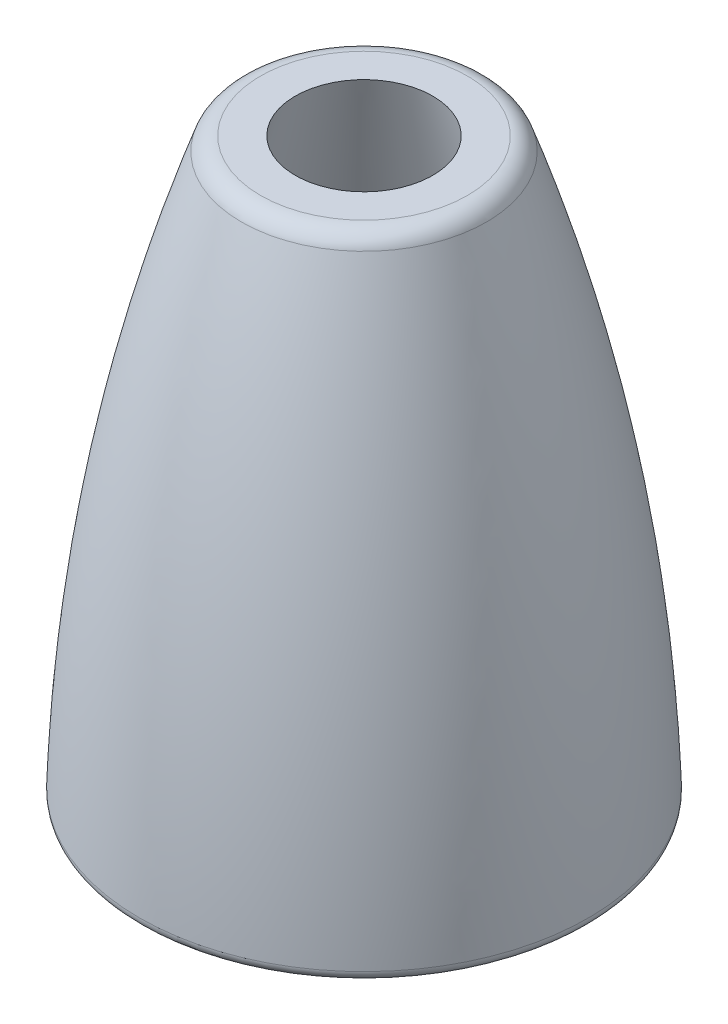
ISO-10303-21;
HEADER;
FILE_DESCRIPTION(('STEP AP214'),'2;1');
FILE_NAME('part.step','',(''),(''),'','','');
FILE_SCHEMA(('AUTOMOTIVE_DESIGN { 1 0 10303 214 1 1 1 1 }'));
ENDSEC;
DATA;
#1=APPLICATION_CONTEXT('core data for automotive mechanical design processes');
#2=APPLICATION_PROTOCOL_DEFINITION('international standard','automotive_design',2000,#1);
#3=PRODUCT_CONTEXT('',#1,'mechanical');
#4=PRODUCT('Part','Part','',(#3));
#5=PRODUCT_RELATED_PRODUCT_CATEGORY('part','',(#4));
#6=PRODUCT_DEFINITION_FORMATION('','',#4);
#7=PRODUCT_DEFINITION_CONTEXT('part definition',#1,'design');
#8=PRODUCT_DEFINITION('design','',#6,#7);
#9=PRODUCT_DEFINITION_SHAPE('','',#8);
#10=(LENGTH_UNIT() NAMED_UNIT(*) SI_UNIT(.MILLI.,.METRE.));
#11=(NAMED_UNIT(*) PLANE_ANGLE_UNIT() SI_UNIT($,.RADIAN.));
#12=(NAMED_UNIT(*) SI_UNIT($,.STERADIAN.) SOLID_ANGLE_UNIT());
#13=UNCERTAINTY_MEASURE_WITH_UNIT(LENGTH_MEASURE(1.E-05),#10,'distance_accuracy_value','');
#14=(GEOMETRIC_REPRESENTATION_CONTEXT(3) GLOBAL_UNCERTAINTY_ASSIGNED_CONTEXT((#13)) GLOBAL_UNIT_ASSIGNED_CONTEXT((#10,
#11,#12)) REPRESENTATION_CONTEXT('',''));
#15=CARTESIAN_POINT('',(0.,0.,0.));
#16=DIRECTION('',(0.,0.,1.));
#17=DIRECTION('',(1.,0.,0.));
#18=AXIS2_PLACEMENT_3D('',#15,#16,#17);
#19=CARTESIAN_POINT('',(0.,15.2,0.));
#20=DIRECTION('',(0.,-1.,0.));
#21=DIRECTION('',(0.,0.,-1.));
#22=AXIS2_PLACEMENT_3D('',#19,#20,#21);
#23=PLANE('',#22);
#24=DIRECTION('',(-0.00914718851659997,0.,0.999958163595979));
#25=VECTOR('',#24,1.);
#26=CARTESIAN_POINT('',(5.6,15.2,0.));
#27=LINE('',#26,#25);
#28=CARTESIAN_POINT('',(5.6,15.2,0.));
#29=VERTEX_POINT('',#28);
#30=CARTESIAN_POINT('',(5.59906288415433,15.2,0.102444225175011));
#31=VERTEX_POINT('',#30);
#32=EDGE_CURVE('E63',#29,#31,#27,.T.);
#33=ORIENTED_EDGE('',*,*,#32,.T.);
#34=CARTESIAN_POINT('',(0.,15.2,0.));
#35=DIRECTION('',(0.,-1.,0.));
#36=DIRECTION('',(0.,0.,-1.));
#37=AXIS2_PLACEMENT_3D('',#34,#35,#36);
#38=CIRCLE('',#37,5.59999999999999);
#39=CARTESIAN_POINT('',(-5.6,15.2,0.));
#40=VERTEX_POINT('',#39);
#41=EDGE_CURVE('E60',#31,#40,#38,.T.);
#42=ORIENTED_EDGE('',*,*,#41,.T.);
#43=DIRECTION('',(0.00919737743597815,0.,-0.999957703229642));
#44=VECTOR('',#43,1.);
#45=CARTESIAN_POINT('',(-5.6,15.2,0.));
#46=LINE('',#45,#44);
#47=CARTESIAN_POINT('',(-5.59906031348,15.2,-0.102444178140847));
#48=VERTEX_POINT('',#47);
#49=EDGE_CURVE('E20',#40,#48,#46,.T.);
#50=ORIENTED_EDGE('',*,*,#49,.T.);
#51=CARTESIAN_POINT('',(0.,15.2,0.));
#52=DIRECTION('',(0.,-1.,0.));
#53=DIRECTION('',(0.,0.,-1.));
#54=AXIS2_PLACEMENT_3D('',#51,#52,#53);
#55=CIRCLE('',#54,5.59999999999999);
#56=EDGE_CURVE('E58',#48,#29,#55,.T.);
#57=ORIENTED_EDGE('',*,*,#56,.T.);
#58=EDGE_LOOP('',(#33,#42,#50,#57));
#59=FACE_BOUND('',#58,.T.);
#60=CARTESIAN_POINT('',(0.,15.2,0.));
#61=DIRECTION('',(0.,-1.,0.));
#62=DIRECTION('',(0.,0.,-1.));
#63=AXIS2_PLACEMENT_3D('',#60,#61,#62);
#64=CIRCLE('',#63,3.525);
#65=CARTESIAN_POINT('',(0.,15.2,-3.525));
#66=VERTEX_POINT('',#65);
#67=EDGE_CURVE('E61',#66,#66,#64,.F.);
#68=ORIENTED_EDGE('',*,*,#67,.T.);
#69=EDGE_LOOP('',(#68));
#70=FACE_BOUND('',#69,.T.);
#71=ADVANCED_FACE('F16',(#59,#70),#23,.T.);
#72=CARTESIAN_POINT('',(0.,29.38420303264,0.));
#73=DIRECTION('',(0.,-1.,0.));
#74=DIRECTION('',(0.,0.,-1.));
#75=AXIS2_PLACEMENT_3D('',#72,#73,#74);
#76=CYLINDRICAL_SURFACE('',#75,3.525);
#77=ORIENTED_EDGE('',*,*,#67,.F.);
#78=EDGE_LOOP('',(#77));
#79=FACE_BOUND('',#78,.T.);
#80=CARTESIAN_POINT('',(0.,24.,0.));
#81=DIRECTION('',(0.,-1.,0.));
#82=DIRECTION('',(0.,0.,-1.));
#83=AXIS2_PLACEMENT_3D('',#80,#81,#82);
#84=CIRCLE('',#83,3.525);
#85=CARTESIAN_POINT('',(0.,24.,-3.525));
#86=VERTEX_POINT('',#85);
#87=EDGE_CURVE('E69',#86,#86,#84,.F.);
#88=ORIENTED_EDGE('',*,*,#87,.T.);
#89=EDGE_LOOP('',(#88));
#90=FACE_BOUND('',#89,.T.);
#91=ADVANCED_FACE('F158',(#79,#90),#76,.F.);
#92=CARTESIAN_POINT('',(0.,13.2,0.));
#93=DIRECTION('',(0.,-1.,0.));
#94=DIRECTION('',(0.,0.,-1.));
#95=AXIS2_PLACEMENT_3D('',#92,#93,#94);
#96=TOROIDAL_SURFACE('',#95,5.60000000000001,2.);
#97=CARTESIAN_POINT('',(0.,13.2,0.));
#98=DIRECTION('',(0.,-1.,0.));
#99=DIRECTION('',(0.,0.,-1.));
#100=AXIS2_PLACEMENT_3D('',#97,#98,#99);
#101=CIRCLE('',#100,7.6);
#102=CARTESIAN_POINT('',(0.,13.2,-7.6));
#103=VERTEX_POINT('',#102);
#104=EDGE_CURVE('E72',#103,#103,#101,.T.);
#105=ORIENTED_EDGE('',*,*,#104,.T.);
#106=EDGE_LOOP('',(#105));
#107=FACE_BOUND('',#106,.T.);
#108=ORIENTED_EDGE('',*,*,#56,.F.);
#109=ORIENTED_EDGE('',*,*,#49,.F.);
#110=ORIENTED_EDGE('',*,*,#41,.F.);
#111=ORIENTED_EDGE('',*,*,#32,.F.);
#112=EDGE_LOOP('',(#108,#109,#110,#111));
#113=FACE_BOUND('',#112,.T.);
#114=ADVANCED_FACE('F62',(#107,#113),#96,.F.);
#115=CARTESIAN_POINT('',(0.,24.,0.));
#116=DIRECTION('',(0.,-1.,0.));
#117=DIRECTION('',(0.,0.,-1.));
#118=AXIS2_PLACEMENT_3D('',#115,#116,#117);
#119=PLANE('',#118);
#120=CARTESIAN_POINT('',(0.,24.,0.));
#121=DIRECTION('',(0.,-1.,0.));
#122=DIRECTION('',(0.,0.,-1.));
#123=AXIS2_PLACEMENT_3D('',#120,#121,#122);
#124=CIRCLE('',#123,5.025);
#125=CARTESIAN_POINT('',(0.,24.,-5.025));
#126=VERTEX_POINT('',#125);
#127=EDGE_CURVE('E73',#126,#126,#124,.F.);
#128=ORIENTED_EDGE('',*,*,#127,.T.);
#129=EDGE_LOOP('',(#128));
#130=FACE_BOUND('',#129,.T.);
#131=ORIENTED_EDGE('',*,*,#87,.F.);
#132=EDGE_LOOP('',(#131));
#133=FACE_BOUND('',#132,.T.);
#134=ADVANCED_FACE('F153',(#130,#133),#119,.F.);
#135=CARTESIAN_POINT('',(0.,29.38420303264,0.));
#136=DIRECTION('',(0.,-1.,0.));
#137=DIRECTION('',(0.,0.,-1.));
#138=AXIS2_PLACEMENT_3D('',#135,#136,#137);
#139=CYLINDRICAL_SURFACE('',#138,7.6);
#140=ORIENTED_EDGE('',*,*,#104,.F.);
#141=EDGE_LOOP('',(#140));
#142=FACE_BOUND('',#141,.T.);
#143=CARTESIAN_POINT('',(0.,2.4,0.));
#144=DIRECTION('',(0.,-1.,0.));
#145=DIRECTION('',(0.,0.,-1.));
#146=AXIS2_PLACEMENT_3D('',#143,#144,#145);
#147=CIRCLE('',#146,7.6);
#148=CARTESIAN_POINT('',(0.,2.4,-7.6));
#149=VERTEX_POINT('',#148);
#150=EDGE_CURVE('E76',#149,#149,#147,.F.);
#151=ORIENTED_EDGE('',*,*,#150,.F.);
#152=EDGE_LOOP('',(#151));
#153=FACE_BOUND('',#152,.T.);
#154=ADVANCED_FACE('F149',(#142,#153),#139,.F.);
#155=CARTESIAN_POINT('',(0.,29.38420303264,0.));
#156=DIRECTION('',(0.,-1.,0.));
#157=DIRECTION('',(0.,0.,-1.));
#158=AXIS2_PLACEMENT_3D('',#155,#156,#157);
#159=CYLINDRICAL_SURFACE('',#158,5.025);
#160=ORIENTED_EDGE('',*,*,#127,.F.);
#161=EDGE_LOOP('',(#160));
#162=FACE_BOUND('',#161,.T.);
#163=CARTESIAN_POINT('',(0.,25.0000000000909,0.));
#164=DIRECTION('',(0.,-1.,0.));
#165=DIRECTION('',(0.,0.,-1.));
#166=AXIS2_PLACEMENT_3D('',#163,#164,#165);
#167=CIRCLE('',#166,5.02499999998918);
#168=CARTESIAN_POINT('',(0.,25.0000000000909,-5.02499999998918));
#169=VERTEX_POINT('',#168);
#170=EDGE_CURVE('E79',#169,#169,#167,.F.);
#171=ORIENTED_EDGE('',*,*,#170,.T.);
#172=EDGE_LOOP('',(#171));
#173=FACE_BOUND('',#172,.T.);
#174=ADVANCED_FACE('F133',(#162,#173),#159,.F.);
#175=CARTESIAN_POINT('',(0.,2.4,-21.5));
#176=DIRECTION('',(0.,-1.,0.));
#177=DIRECTION('',(0.,0.,-1.));
#178=AXIS2_PLACEMENT_3D('',#175,#176,#177);
#179=PLANE('',#178);
#180=CARTESIAN_POINT('',(-3.03576608295941E-13,2.4,2.87725843584746E-11));
#181=DIRECTION('',(0.,1.,0.));
#182=DIRECTION('',(0.,0.,1.));
#183=AXIS2_PLACEMENT_3D('',#180,#181,#182);
#184=CIRCLE('',#183,10.6542866382603);
#185=CARTESIAN_POINT('',(10.6536899184604,2.40000000000429,0.112621861908318));
#186=VERTEX_POINT('',#185);
#187=CARTESIAN_POINT('',(-10.65428663826,2.4,0.));
#188=VERTEX_POINT('',#187);
#189=EDGE_CURVE('E80',#186,#188,#184,.T.);
#190=ORIENTED_EDGE('',*,*,#189,.F.);
#191=CARTESIAN_POINT('',(-10.65428663826,2.4,0.));
#192=CARTESIAN_POINT('',(-10.6542689654252,2.39999999830858,0.143919287529837));
#193=CARTESIAN_POINT('',(-10.6513574592582,2.39999999773107,0.287843408679064));
#194=CARTESIAN_POINT('',(-10.6397446924835,2.40000000255313,0.575452835882171));
#195=CARTESIAN_POINT('',(-10.6310436312798,2.40000000795251,0.719138149990188));
#196=CARTESIAN_POINT('',(-10.6107488432834,2.40000002591153,0.970170610886358));
#197=CARTESIAN_POINT('',(-10.6004220566456,2.4000000363437,1.07762217602543));
#198=CARTESIAN_POINT('',(-10.5765691163456,2.40000014385088,1.29217199450075));
#199=CARTESIAN_POINT('',(-10.5630430012679,2.40000024092485,1.39927025208218));
#200=CARTESIAN_POINT('',(-10.535752312596,2.40000030857561,1.59092289349643));
#201=CARTESIAN_POINT('',(-10.5226133248162,2.40000030112809,1.67556731398593));
#202=CARTESIAN_POINT('',(-10.4810718321089,2.40000024267947,1.92321301128468));
#203=CARTESIAN_POINT('',(-10.4498527563828,2.4000001575678,2.08575152538939));
#204=CARTESIAN_POINT('',(-10.3846237503688,2.40000005228976,2.38727630128094));
#205=CARTESIAN_POINT('',(-10.3515649659946,2.40000002488674,2.52647001874884));
#206=CARTESIAN_POINT('',(-10.2883486349572,2.40000000196427,2.77073014982354));
#207=CARTESIAN_POINT('',(-10.2593480934118,2.40000000044585,2.8760969424706));
#208=CARTESIAN_POINT('',(-10.2032715490783,2.39999999962856,3.068392670818));
#209=CARTESIAN_POINT('',(-10.1766822462099,2.40000000000152,3.15546366099328));
#210=CARTESIAN_POINT('',(-10.1212742313736,2.40000000053643,3.32889135840802));
#211=CARTESIAN_POINT('',(-10.0924555225762,2.40000000069838,3.41524806666308));
#212=CARTESIAN_POINT('',(-10.0026970386529,2.40000000135446,3.67316629896762));
#213=CARTESIAN_POINT('',(-9.93845063392781,2.40000000201884,3.84359058201102));
#214=CARTESIAN_POINT('',(-9.80131387731575,2.40000000307656,4.18091500733054));
#215=CARTESIAN_POINT('',(-9.72842353771891,2.4000000034699,4.34781515461696));
#216=CARTESIAN_POINT('',(-9.57418876683898,2.40000000386674,4.67766494088835));
#217=CARTESIAN_POINT('',(-9.49284433955938,2.40000000387024,4.84061458174408));
#218=CARTESIAN_POINT('',(-9.32191540324746,2.40000000346465,5.16213249971454));
#219=CARTESIAN_POINT('',(-9.23233089030359,2.40000000305557,5.32070077474941));
#220=CARTESIAN_POINT('',(-9.04515641883491,2.40000000203542,5.63304070655637));
#221=CARTESIAN_POINT('',(-8.94756644891892,2.40000000142435,5.78681235650279));
#222=CARTESIAN_POINT('',(-8.74463865936752,2.40000000040542,6.08915477896542));
#223=CARTESIAN_POINT('',(-8.63930082136096,2.39999999999756,6.23772553914845));
#224=CARTESIAN_POINT('',(-8.41020711726413,2.40000000000269,6.54390032354204));
#225=CARTESIAN_POINT('',(-8.28566366259152,2.40000000050213,6.70091550779718));
#226=CARTESIAN_POINT('',(-8.0245635434954,2.4000000020686,7.01166508144463));
#227=CARTESIAN_POINT('',(-7.88777887686231,2.40000000315004,7.16520833740024));
#228=CARTESIAN_POINT('',(-7.67479101851897,2.40000000494652,7.39079700050716));
#229=CARTESIAN_POINT('',(-7.60177810882471,2.40000000558113,7.4658794371768));
#230=CARTESIAN_POINT('',(-7.4526470609581,2.4000000068793,7.61478060303627));
#231=CARTESIAN_POINT('',(-7.37650161345749,2.40000000754313,7.68857204267664));
#232=CARTESIAN_POINT('',(-7.2210945686466,2.40000000886775,7.83473956862671));
#233=CARTESIAN_POINT('',(-7.14180619840818,2.40000000952841,7.90708717467028));
#234=CARTESIAN_POINT('',(-6.9801049225498,2.40000001081896,8.05021586278085));
#235=CARTESIAN_POINT('',(-6.89766579162835,2.40000001144838,8.12096732297199));
#236=CARTESIAN_POINT('',(-6.72966198850291,2.4000000126523,8.26074781647359));
#237=CARTESIAN_POINT('',(-6.64407170732765,2.40000001322605,8.32974607068237));
#238=CARTESIAN_POINT('',(-6.4697710814335,2.40000001429818,8.4658611868031));
#239=CARTESIAN_POINT('',(-6.38103579891656,2.4000000147956,8.53294611727492));
#240=CARTESIAN_POINT('',(-6.20045780221209,2.40000001569834,8.66507237939187));
#241=CARTESIAN_POINT('',(-6.10859088151632,2.40000001610253,8.73008062982968));
#242=CARTESIAN_POINT('',(-5.92176963588495,2.40000001680581,8.85788843957988));
#243=CARTESIAN_POINT('',(-5.82679189585519,2.40000001710363,8.92065377447998));
#244=CARTESIAN_POINT('',(-5.63377678980184,2.40000001758488,9.04380801520357));
#245=CARTESIAN_POINT('',(-5.53571686153046,2.40000001776696,9.10416156241783));
#246=CARTESIAN_POINT('',(-5.33657322732413,2.40000001801114,9.22232214694561));
#247=CARTESIAN_POINT('',(-5.23546787424722,2.40000001807186,9.28009270347657));
#248=CARTESIAN_POINT('',(-5.03027763116661,2.40000001807147,9.39291520059263));
#249=CARTESIAN_POINT('',(-4.92617207220108,2.40000001800899,9.4479295532585));
#250=CARTESIAN_POINT('',(-4.71503436328771,2.40000001776403,9.55506585758364));
#251=CARTESIAN_POINT('',(-4.60798258629679,2.40000001758024,9.60714913238561));
#252=CARTESIAN_POINT('',(-4.39101439717269,2.40000001709826,9.70824818850018));
#253=CARTESIAN_POINT('',(-4.28107946419287,2.40000001679883,9.75722422548242));
#254=CARTESIAN_POINT('',(-4.05841622285273,2.40000001609488,9.85193280435814));
#255=CARTESIAN_POINT('',(-3.94567056451431,2.40000001568925,9.89762455929158));
#256=CARTESIAN_POINT('',(-3.71746671809562,2.40000001478591,9.98558808839484));
#257=CARTESIAN_POINT('',(-3.60199241582189,2.40000001428727,10.0278180613017));
#258=CARTESIAN_POINT('',(-3.36842198050451,2.40000001321465,10.1086815085291));
#259=CARTESIAN_POINT('',(-3.25031103404552,2.40000001263994,10.1472721991937));
#260=CARTESIAN_POINT('',(-3.01156811569287,2.40000001143568,10.2206810111957));
#261=CARTESIAN_POINT('',(-2.89092269607751,2.40000001080561,10.2554554020755));
#262=CARTESIAN_POINT('',(-2.64722197223107,2.40000000951486,10.3210564959765));
#263=CARTESIAN_POINT('',(-2.52415465056554,2.40000000885391,10.3518385610883));
#264=CARTESIAN_POINT('',(-2.27573183046901,2.40000000752934,10.409281373211));
#265=CARTESIAN_POINT('',(-2.1503658092037,2.40000000686575,10.4358966180933));
#266=CARTESIAN_POINT('',(-1.8974779890401,2.40000000556757,10.4848341948264));
#267=CARTESIAN_POINT('',(-1.76994722486463,2.40000000493334,10.5071102073588));
#268=CARTESIAN_POINT('',(-1.51287343186185,2.40000000372925,10.5472003921));
#269=CARTESIAN_POINT('',(-1.3833230599813,2.40000000316012,10.5649674792923));
#270=CARTESIAN_POINT('',(-1.12236385196942,2.40000000212543,10.5958739874785));
#271=CARTESIAN_POINT('',(-0.990949348874298,2.40000000166097,10.608965611514));
#272=CARTESIAN_POINT('',(-0.726429741988141,2.40000000087828,10.6303597767161));
#273=CARTESIAN_POINT('',(-0.593320736252382,2.40000000056154,10.638613873501));
#274=CARTESIAN_POINT('',(-0.32558025454125,2.4000000001218,10.6501740923384));
#275=CARTESIAN_POINT('',(-0.190946592522561,2.40000000000072,10.6534311662041));
#276=CARTESIAN_POINT('',(-0.0470284588738655,2.39999999999995,10.6541865442615));
#277=CARTESIAN_POINT('',(-0.0377444618552427,2.40000000000047,10.6542231453236));
#278=CARTESIAN_POINT('',(-0.0189736752545771,2.40000000000061,10.654273174296));
#279=CARTESIAN_POINT('',(-0.00948688460339239,2.4000000000002,10.6542860786969));
#280=CARTESIAN_POINT('',(0.191013888883362,2.39999999999809,10.6542910328116));
#281=CARTESIAN_POINT('',(0.382065865956335,2.40000000011982,10.6491593505252));
#282=CARTESIAN_POINT('',(0.763596773054154,2.40000000056937,10.6286303474993));
#283=CARTESIAN_POINT('',(0.954075702099103,2.40000000089718,10.6132330092158));
#284=CARTESIAN_POINT('',(1.34128028737617,2.40000000172442,10.5714259642177));
#285=CARTESIAN_POINT('',(1.53796279719374,2.40000000222999,10.5446135831903));
#286=CARTESIAN_POINT('',(1.92952143768506,2.40000000336103,10.4800470497553));
#287=CARTESIAN_POINT('',(2.12439756563847,2.40000000398649,10.4422928808724));
#288=CARTESIAN_POINT('',(2.51173827947328,2.40000000531231,10.3559606841277));
#289=CARTESIAN_POINT('',(2.70420286205415,2.40000000601268,10.3073826414536));
#290=CARTESIAN_POINT('',(3.08611894087873,2.40000000744787,10.1995542580399));
#291=CARTESIAN_POINT('',(3.27557043341227,2.40000000818269,10.14030390416));
#292=CARTESIAN_POINT('',(3.6508692382591,2.40000000965055,10.0113158094691));
#293=CARTESIAN_POINT('',(3.83671654662911,2.40000001038358,9.94157805718461));
#294=CARTESIAN_POINT('',(4.20422685751157,2.4000000118159,9.79183280306576));
#295=CARTESIAN_POINT('',(4.38588985602035,2.40000001251518,9.71182529140541));
#296=CARTESIAN_POINT('',(4.74446455646986,2.40000001385233,9.54179021538459));
#297=CARTESIAN_POINT('',(4.9213762545165,2.4000000144902,9.45176264281212));
#298=CARTESIAN_POINT('',(5.26989617296175,2.4000000156811,9.26196841850885));
#299=CARTESIAN_POINT('',(5.44150438974156,2.40000001623413,9.16220176013281));
#300=CARTESIAN_POINT('',(5.77888172351382,2.40000001723625,8.95324073829535));
#301=CARTESIAN_POINT('',(5.94465083732331,2.40000001768533,8.84404636969491));
#302=CARTESIAN_POINT('',(6.26983256719389,2.40000001846469,8.61657072979846));
#303=CARTESIAN_POINT('',(6.4292451806623,2.40000001879496,8.49828945479618));
#304=CARTESIAN_POINT('',(6.74121635308807,2.40000001932612,8.25300916901855));
#305=CARTESIAN_POINT('',(6.89377491019043,2.40000001952701,8.12601015588383));
#306=CARTESIAN_POINT('',(7.19156180707351,2.40000001979311,7.86369077287557));
#307=CARTESIAN_POINT('',(7.33679014587629,2.40000001985832,7.72837040189188));
#308=CARTESIAN_POINT('',(7.61946332388734,2.40000001985103,7.44983065697628));
#309=CARTESIAN_POINT('',(7.75690816312532,2.40000001977853,7.30661128307452));
#310=CARTESIAN_POINT('',(8.02358535526072,2.40000001949807,7.01272054241503));
#311=CARTESIAN_POINT('',(8.15281770931649,2.40000001929011,6.86204917670838));
#312=CARTESIAN_POINT('',(8.40266657904466,2.40000001874527,6.55372472340272));
#313=CARTESIAN_POINT('',(8.52328309711465,2.40000001840838,6.39607163774658));
#314=CARTESIAN_POINT('',(8.75552383669356,2.40000001761648,6.07427580832816));
#315=CARTESIAN_POINT('',(8.86714806193882,2.40000001716147,5.9101330672624));
#316=CARTESIAN_POINT('',(9.08105582665245,2.4000000161484,5.57587024754151));
#317=CARTESIAN_POINT('',(9.18333937128372,2.40000001559034,5.40575017219033));
#318=CARTESIAN_POINT('',(9.37824654237508,2.40000001439053,5.06006366184002));
#319=CARTESIAN_POINT('',(9.47087017550015,2.40000001374878,4.88449723059878));
#320=CARTESIAN_POINT('',(9.64616844336396,2.40000001240522,4.52846598618357));
#321=CARTESIAN_POINT('',(9.72884308633243,2.4000000117034,4.34800117706165));
#322=CARTESIAN_POINT('',(9.88398535257184,2.40000001026762,3.98273644401866));
#323=CARTESIAN_POINT('',(9.95645298568663,2.40000000953366,3.79793652427867));
#324=CARTESIAN_POINT('',(10.0909550590335,2.40000000806575,3.42457836709743));
#325=CARTESIAN_POINT('',(10.1529895107593,2.40000000733181,3.23602013379679));
#326=CARTESIAN_POINT('',(10.2664316627028,2.40000000590042,2.85573387996979));
#327=CARTESIAN_POINT('',(10.3178393760859,2.40000000520297,2.66400586337074));
#328=CARTESIAN_POINT('',(10.4098674858571,2.40000000388528,2.27797845453466));
#329=CARTESIAN_POINT('',(10.4504878970899,2.40000000326503,2.08367906583651));
#330=CARTESIAN_POINT('',(10.52081517327,2.40000000214683,1.69311539349087));
#331=CARTESIAN_POINT('',(10.5505220547331,2.40000000164886,1.49685111281741));
#332=CARTESIAN_POINT('',(10.5989276302434,2.40000000082426,1.10297010376945));
#333=CARTESIAN_POINT('',(10.6176263424604,2.40000000049763,0.905353377627839));
#334=CARTESIAN_POINT('',(10.6439645479174,2.40000000007014,0.509384760559068));
#335=CARTESIAN_POINT('',(10.6516040609293,2.3999999999693,0.311032870946887));
#336=CARTESIAN_POINT('',(10.6536884539806,2.40000000000858,0.112621846399577));
#337=B_SPLINE_CURVE_WITH_KNOTS('',3,(#191,#192,#193,#194,#195,#196,#197,#198,#199,#200,#201,
#202,#203,#204,#205,#206,#207,#208,#209,#210,#211,#212,#213,#214,#215,#216,#217,#218,#219,#220,
#221,#222,#223,#224,#225,#226,#227,#228,#229,#230,#231,#232,#233,#234,#235,#236,#237,#238,#239,
#240,#241,#242,#243,#244,#245,#246,#247,#248,#249,#250,#251,#252,#253,#254,#255,#256,#257,#258,
#259,#260,#261,#262,#263,#264,#265,#266,#267,#268,#269,#270,#271,#272,#273,#274,#275,#276,#277,
#278,#279,#280,#281,#282,#283,#284,#285,#286,#287,#288,#289,#290,#291,#292,#293,#294,#295,#296,
#297,#298,#299,#300,#301,#302,#303,#304,#305,#306,#307,#308,#309,#310,#311,#312,#313,#314,#315,
#316,#317,#318,#319,#320,#321,#322,#323,#324,#325,#326,#327,#328,#329,#330,#331,#332,#333,#334,
#335,#336),.UNSPECIFIED.,.F.,.F.,(4,2,2,2,2,2,2,2,2,2,2,2,2,2,2,2,2,2,2,2,2,2,2,2,2,2,2,2,2,2,2,
2,2,2,2,2,2,2,2,2,2,2,2,2,2,2,2,2,2,2,2,2,2,2,2,2,2,2,2,2,2,2,2,2,2,2,2,2,2,2,2,2,4),(0.,
0.431738984942221,0.863463100688874,1.18725872471448,1.51105044388004,1.7680036281368,
2.26433094141186,2.69341494362834,3.02121974758522,3.29431064740003,3.56740115885592,
4.11353645101099,4.65967096666832,5.20580522370128,5.75193973998333,6.29807503338784,
6.84421162178822,7.44513204955969,8.06166015323436,8.37581105823764,8.69386495801826,
9.01582180951017,9.34168156800898,9.67144418717206,10.0051096190185,10.3426778139291,
10.6841487206466,11.0295222862753,11.3787984562814,11.7319771744931,12.0890583831002,
12.4500420226545,12.8149280320698,13.1837163486214,13.556406907947,13.9329996440459,
14.3134944892794,14.697891374371,15.0861902284058,15.4783909788312,15.8744935514566,
16.2744978704531,16.6784038583544,16.706256088868,16.7347165554273,17.307754451861,
17.8807933276188,18.4759829075216,19.0711733836132,19.6663646742154,20.2615566976498,
20.8567493722382,21.4519426163022,22.0471363481634,22.6423304861438,23.2375249485648,
23.8327196537482,24.4279145200158,25.0231094656892,25.6183044090901,26.2134992685402,
26.8086939623612,27.4038884088748,27.9990825264027,28.5942762332667,29.1894694477883,
29.7846620882893,30.3798540730915,30.9750453205164,31.5702357488858,32.1654252765214,
32.7606138217448,33.3558013028778),.UNSPECIFIED.);
#338=EDGE_CURVE('E83',#188,#186,#337,.T.);
#339=ORIENTED_EDGE('',*,*,#338,.F.);
#340=EDGE_LOOP('',(#190,#339));
#341=FACE_BOUND('',#340,.T.);
#342=ORIENTED_EDGE('',*,*,#150,.T.);
#343=EDGE_LOOP('',(#342));
#344=FACE_BOUND('',#343,.T.);
#345=ADVANCED_FACE('F137',(#341,#344),#179,.T.);
#346=CARTESIAN_POINT('',(0.,25.0000000001478,0.));
#347=DIRECTION('',(0.,-1.,0.));
#348=DIRECTION('',(0.,0.,-1.));
#349=AXIS2_PLACEMENT_3D('',#346,#347,#348);
#350=CONICAL_SURFACE('',#349,5.02499999996076,0.261977344229614);
#351=ORIENTED_EDGE('',*,*,#170,.F.);
#352=EDGE_LOOP('',(#351));
#353=FACE_BOUND('',#352,.T.);
#354=CARTESIAN_POINT('',(0.,30.9999999999491,0.));
#355=DIRECTION('',(0.,-1.,0.));
#356=DIRECTION('',(0.,0.,-1.));
#357=AXIS2_PLACEMENT_3D('',#354,#355,#356);
#358=CIRCLE('',#357,3.41616039207999);
#359=CARTESIAN_POINT('',(0.,30.9999999999491,-3.41616039207999));
#360=VERTEX_POINT('',#359);
#361=EDGE_CURVE('E82',#360,#360,#358,.T.);
#362=ORIENTED_EDGE('',*,*,#361,.F.);
#363=EDGE_LOOP('',(#362));
#364=FACE_BOUND('',#363,.T.);
#365=ADVANCED_FACE('F114',(#353,#364),#350,.F.);
#366=CARTESIAN_POINT('',(0.,31.,0.));
#367=DIRECTION('',(0.,1.,0.));
#368=DIRECTION('',(0.,0.,1.));
#369=AXIS2_PLACEMENT_3D('',#366,#367,#368);
#370=PLANE('',#369);
#371=CARTESIAN_POINT('',(0.,31.,0.));
#372=DIRECTION('',(0.,1.,0.));
#373=DIRECTION('',(0.,0.,1.));
#374=AXIS2_PLACEMENT_3D('',#371,#372,#373);
#375=CIRCLE('',#374,5.142709066435);
#376=CARTESIAN_POINT('',(5.142709066435,31.,0.));
#377=VERTEX_POINT('',#376);
#378=CARTESIAN_POINT('',(5.14246453578035,31.,-0.0501036575441729));
#379=VERTEX_POINT('',#378);
#380=EDGE_CURVE('E34',#377,#379,#375,.F.);
#381=ORIENTED_EDGE('',*,*,#380,.F.);
#382=DIRECTION('',(-0.00488948651745629,0.,-0.999988046389353));
#383=VECTOR('',#382,1.);
#384=CARTESIAN_POINT('',(5.142709066435,31.,0.));
#385=LINE('',#384,#383);
#386=EDGE_CURVE('E86',#377,#379,#385,.T.);
#387=ORIENTED_EDGE('',*,*,#386,.T.);
#388=EDGE_LOOP('',(#381,#387));
#389=FACE_BOUND('',#388,.T.);
#390=ORIENTED_EDGE('',*,*,#361,.T.);
#391=EDGE_LOOP('',(#390));
#392=FACE_BOUND('',#391,.T.);
#393=ADVANCED_FACE('F104',(#389,#392),#370,.T.);
#394=CARTESIAN_POINT('',(0.,2.9,0.));
#395=DIRECTION('',(0.,1.,0.));
#396=DIRECTION('',(0.,0.,1.));
#397=AXIS2_PLACEMENT_3D('',#394,#395,#396);
#398=TOROIDAL_SURFACE('',#397,10.6542866382582,0.500000000001796);
#399=ORIENTED_EDGE('',*,*,#338,.T.);
#400=ORIENTED_EDGE('',*,*,#189,.T.);
#401=EDGE_LOOP('',(#399,#400));
#402=FACE_BOUND('',#401,.T.);
#403=CARTESIAN_POINT('',(0.,2.91575931232105,-3.97425148346287E-12));
#404=DIRECTION('',(0.,1.,0.));
#405=DIRECTION('',(0.,0.,1.));
#406=AXIS2_PLACEMENT_3D('',#403,#404,#405);
#407=CIRCLE('',#406,11.1540382206321);
#408=CARTESIAN_POINT('',(0.,2.91575931232105,11.1540382206282));
#409=VERTEX_POINT('',#408);
#410=EDGE_CURVE('E26',#409,#409,#407,.T.);
#411=ORIENTED_EDGE('',*,*,#410,.F.);
#412=EDGE_LOOP('',(#411));
#413=FACE_BOUND('',#412,.T.);
#414=ADVANCED_FACE('F102',(#402,#413),#398,.T.);
#415=CARTESIAN_POINT('',(0.,30.,0.));
#416=DIRECTION('',(0.,1.,0.));
#417=DIRECTION('',(0.,0.,1.));
#418=AXIS2_PLACEMENT_3D('',#415,#416,#417);
#419=TOROIDAL_SURFACE('',#418,5.14270906643501,0.999999999999994);
#420=CARTESIAN_POINT('',(0.,30.3278362805497,-3.97425148346287E-12));
#421=DIRECTION('',(0.,1.,0.));
#422=DIRECTION('',(0.,0.,1.));
#423=AXIS2_PLACEMENT_3D('',#420,#421,#422);
#424=CIRCLE('',#423,6.08744361812104);
#425=CARTESIAN_POINT('',(0.,30.3278362805497,6.08744361811707));
#426=VERTEX_POINT('',#425);
#427=EDGE_CURVE('E11',#426,#426,#424,.F.);
#428=ORIENTED_EDGE('',*,*,#427,.F.);
#429=EDGE_LOOP('',(#428));
#430=FACE_BOUND('',#429,.T.);
#431=ORIENTED_EDGE('',*,*,#380,.T.);
#432=ORIENTED_EDGE('',*,*,#386,.F.);
#433=EDGE_LOOP('',(#431,#432));
#434=FACE_BOUND('',#433,.T.);
#435=ADVANCED_FACE('F18',(#430,#434),#419,.T.);
#436=CARTESIAN_POINT('',(0.,-5.39746199124114E-11,-81.3090909092635));
#437=DIRECTION('',(1.,0.,0.));
#438=DIRECTION('',(0.,0.,1.));
#439=AXIS2_PLACEMENT_3D('',#436,#437,#438);
#440=CIRCLE('',#439,92.5090909092654);
#441=TRIMMED_CURVE('',#440,(PARAMETER_VALUE(-0.497180488659357)),
(PARAMETER_VALUE(0.497180488659357)),.T.,.PARAMETER.);
#442=CARTESIAN_POINT('',(0.,-5.39746199124114E-11,-3.97425148346287E-12));
#443=DIRECTION('',(0.,1.,0.));
#444=AXIS1_PLACEMENT('',#442,#443);
#445=SURFACE_OF_REVOLUTION('',#441,#444);
#446=ORIENTED_EDGE('',*,*,#427,.T.);
#447=EDGE_LOOP('',(#446));
#448=FACE_BOUND('',#447,.T.);
#449=ORIENTED_EDGE('',*,*,#410,.T.);
#450=EDGE_LOOP('',(#449));
#451=FACE_BOUND('',#450,.T.);
#452=ADVANCED_FACE('F112',(#448,#451),#445,.F.);
#453=CLOSED_SHELL('',(#71,#91,#114,#134,#154,#174,#345,#365,#393,#414,#435,#452));
#454=MANIFOLD_SOLID_BREP('B1',#453);
#455=ADVANCED_BREP_SHAPE_REPRESENTATION('',(#18,#454),#14);
#456=SHAPE_DEFINITION_REPRESENTATION(#9,#455);
ENDSEC;
END-ISO-10303-21;
